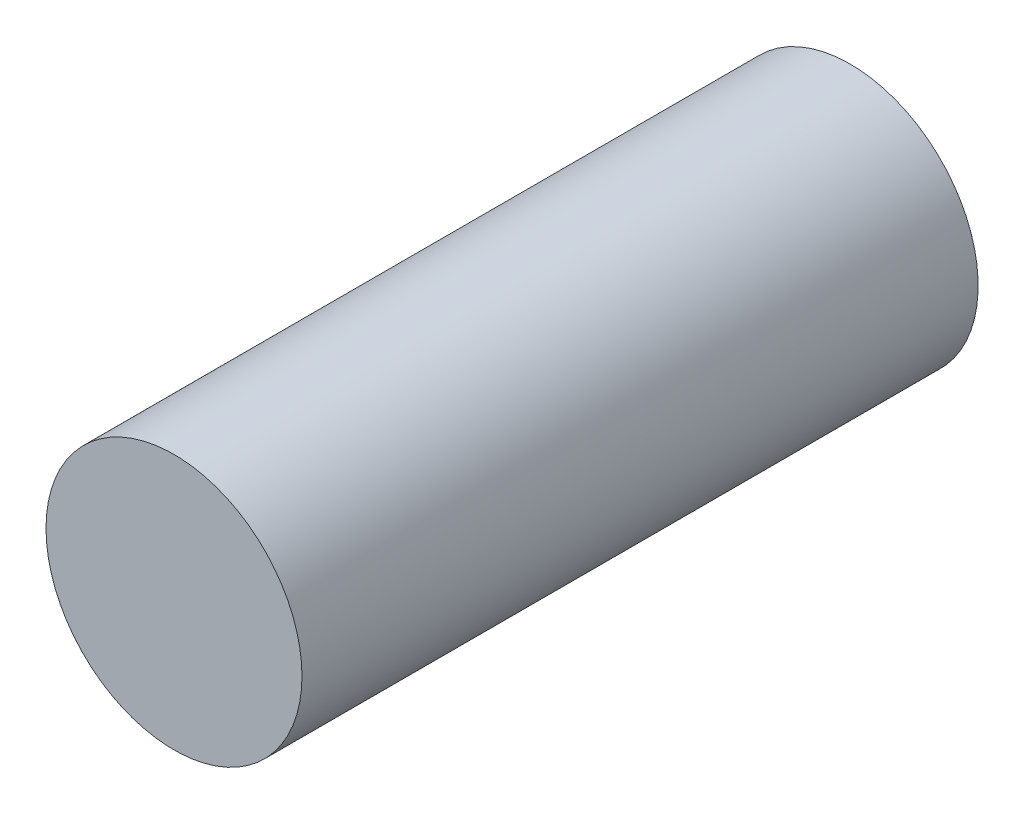
ISO-10303-21;
HEADER;
FILE_DESCRIPTION(('STEP AP214'),'2;1');
FILE_NAME('part.step','',(''),(''),'','','');
FILE_SCHEMA(('AUTOMOTIVE_DESIGN { 1 0 10303 214 1 1 1 1 }'));
ENDSEC;
DATA;
#1=APPLICATION_CONTEXT('core data for automotive mechanical design processes');
#2=APPLICATION_PROTOCOL_DEFINITION('international standard','automotive_design',2000,#1);
#3=PRODUCT_CONTEXT('',#1,'mechanical');
#4=PRODUCT('Part','Part','',(#3));
#5=PRODUCT_RELATED_PRODUCT_CATEGORY('part','',(#4));
#6=PRODUCT_DEFINITION_FORMATION('','',#4);
#7=PRODUCT_DEFINITION_CONTEXT('part definition',#1,'design');
#8=PRODUCT_DEFINITION('design','',#6,#7);
#9=PRODUCT_DEFINITION_SHAPE('','',#8);
#10=(LENGTH_UNIT() NAMED_UNIT(*) SI_UNIT(.MILLI.,.METRE.));
#11=(NAMED_UNIT(*) PLANE_ANGLE_UNIT() SI_UNIT($,.RADIAN.));
#12=(NAMED_UNIT(*) SI_UNIT($,.STERADIAN.) SOLID_ANGLE_UNIT());
#13=UNCERTAINTY_MEASURE_WITH_UNIT(LENGTH_MEASURE(1.E-05),#10,'distance_accuracy_value','');
#14=(GEOMETRIC_REPRESENTATION_CONTEXT(3) GLOBAL_UNCERTAINTY_ASSIGNED_CONTEXT((#13)) GLOBAL_UNIT_ASSIGNED_CONTEXT((#10,
#11,#12)) REPRESENTATION_CONTEXT('',''));
#15=CARTESIAN_POINT('',(0.,0.,0.));
#16=DIRECTION('',(0.,0.,1.));
#17=DIRECTION('',(1.,0.,0.));
#18=AXIS2_PLACEMENT_3D('',#15,#16,#17);
#19=CARTESIAN_POINT('',(0.,0.,304.8));
#20=DIRECTION('',(0.,0.,-1.));
#21=DIRECTION('',(-1.,0.,0.));
#22=AXIS2_PLACEMENT_3D('',#19,#20,#21);
#23=CYLINDRICAL_SURFACE('',#22,50.8);
#24=CARTESIAN_POINT('',(0.,0.,36.4089274766507));
#25=DIRECTION('',(0.,0.,-1.));
#26=DIRECTION('',(-1.,0.,0.));
#27=AXIS2_PLACEMENT_3D('',#24,#25,#26);
#28=CIRCLE('',#27,50.8);
#29=CARTESIAN_POINT('',(-50.8,0.,36.4089274766507));
#30=VERTEX_POINT('',#29);
#31=EDGE_CURVE('E34',#30,#30,#28,.F.);
#32=ORIENTED_EDGE('',*,*,#31,.T.);
#33=EDGE_LOOP('',(#32));
#34=FACE_BOUND('',#33,.T.);
#35=CARTESIAN_POINT('',(0.,0.,304.8));
#36=DIRECTION('',(0.,0.,1.));
#37=DIRECTION('',(1.,0.,0.));
#38=AXIS2_PLACEMENT_3D('',#35,#36,#37);
#39=CIRCLE('',#38,50.8);
#40=CARTESIAN_POINT('',(50.8,0.,304.8));
#41=VERTEX_POINT('',#40);
#42=EDGE_CURVE('E10',#41,#41,#39,.T.);
#43=ORIENTED_EDGE('',*,*,#42,.F.);
#44=EDGE_LOOP('',(#43));
#45=FACE_BOUND('',#44,.T.);
#46=ADVANCED_FACE('F31',(#34,#45),#23,.T.);
#47=CARTESIAN_POINT('',(0.,0.,304.8));
#48=DIRECTION('',(0.,0.,1.));
#49=DIRECTION('',(1.,0.,0.));
#50=AXIS2_PLACEMENT_3D('',#47,#48,#49);
#51=PLANE('',#50);
#52=ORIENTED_EDGE('',*,*,#42,.T.);
#53=EDGE_LOOP('',(#52));
#54=FACE_BOUND('',#53,.T.);
#55=ADVANCED_FACE('F47',(#54),#51,.T.);
#56=CARTESIAN_POINT('',(0.,0.,0.));
#57=DIRECTION('',(0.,-1.,0.));
#58=DIRECTION('',(-1.,0.,0.));
#59=AXIS2_PLACEMENT_3D('',#56,#57,#58);
#60=SPHERICAL_SURFACE('',#59,62.5);
#61=CARTESIAN_POINT('',(0.,0.,0.));
#62=DIRECTION('',(0.,0.,-1.));
#63=DIRECTION('',(-1.,0.,0.));
#64=AXIS2_PLACEMENT_3D('',#61,#62,#63);
#65=SPHERICAL_SURFACE('',#64,62.5);
#66=ORIENTED_EDGE('',*,*,#31,.F.);
#67=EDGE_LOOP('',(#66));
#68=FACE_BOUND('',#67,.T.);
#69=ADVANCED_FACE('F45',(#68),#65,.F.);
#70=CLOSED_SHELL('',(#46,#55,#69));
#71=MANIFOLD_SOLID_BREP('B2',#70);
#72=ADVANCED_BREP_SHAPE_REPRESENTATION('',(#18,#71),#14);
#73=SHAPE_DEFINITION_REPRESENTATION(#9,#72);
ENDSEC;
END-ISO-10303-21;
